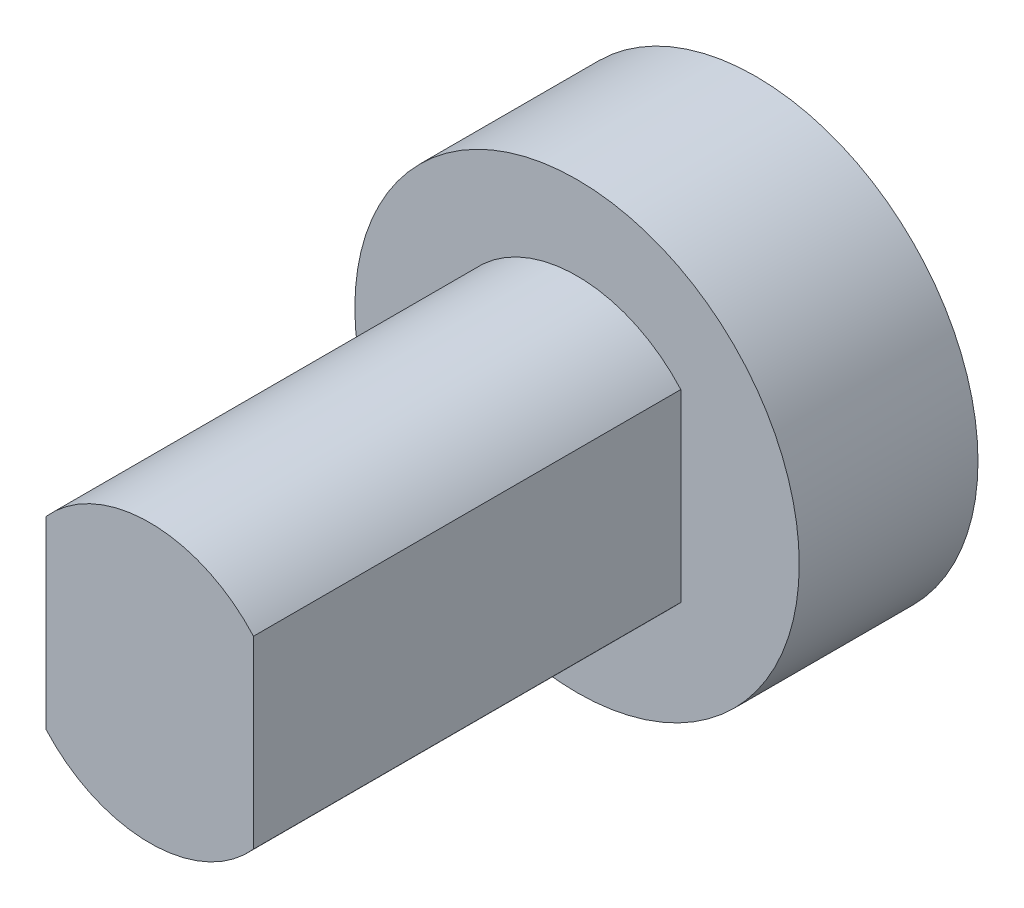
ISO-10303-21;
HEADER;
FILE_DESCRIPTION(('STEP AP214'),'2;1');
FILE_NAME('part.step','',(''),(''),'','','');
FILE_SCHEMA(('AUTOMOTIVE_DESIGN { 1 0 10303 214 1 1 1 1 }'));
ENDSEC;
DATA;
#1=APPLICATION_CONTEXT('core data for automotive mechanical design processes');
#2=APPLICATION_PROTOCOL_DEFINITION('international standard','automotive_design',2000,#1);
#3=PRODUCT_CONTEXT('',#1,'mechanical');
#4=PRODUCT('Part','Part','',(#3));
#5=PRODUCT_RELATED_PRODUCT_CATEGORY('part','',(#4));
#6=PRODUCT_DEFINITION_FORMATION('','',#4);
#7=PRODUCT_DEFINITION_CONTEXT('part definition',#1,'design');
#8=PRODUCT_DEFINITION('design','',#6,#7);
#9=PRODUCT_DEFINITION_SHAPE('','',#8);
#10=(LENGTH_UNIT() NAMED_UNIT(*) SI_UNIT(.MILLI.,.METRE.));
#11=(NAMED_UNIT(*) PLANE_ANGLE_UNIT() SI_UNIT($,.RADIAN.));
#12=(NAMED_UNIT(*) SI_UNIT($,.STERADIAN.) SOLID_ANGLE_UNIT());
#13=UNCERTAINTY_MEASURE_WITH_UNIT(LENGTH_MEASURE(1.E-05),#10,'distance_accuracy_value','');
#14=(GEOMETRIC_REPRESENTATION_CONTEXT(3) GLOBAL_UNCERTAINTY_ASSIGNED_CONTEXT((#13)) GLOBAL_UNIT_ASSIGNED_CONTEXT((#10,
#11,#12)) REPRESENTATION_CONTEXT('',''));
#15=CARTESIAN_POINT('',(0.,0.,0.));
#16=DIRECTION('',(0.,0.,1.));
#17=DIRECTION('',(1.,0.,0.));
#18=AXIS2_PLACEMENT_3D('',#15,#16,#17);
#19=CARTESIAN_POINT('',(0.,-11.0314213562373,0.));
#20=DIRECTION('',(0.,0.,1.));
#21=DIRECTION('',(1.,0.,0.));
#22=AXIS2_PLACEMENT_3D('',#19,#20,#21);
#23=PLANE('',#22);
#24=DIRECTION('',(0.,1.,0.));
#25=VECTOR('',#24,1.);
#26=CARTESIAN_POINT('',(-3.7,-11.0314213562373,0.));
#27=LINE('',#26,#25);
#28=CARTESIAN_POINT('',(-3.7,-3.28823660949147,0.));
#29=VERTEX_POINT('',#28);
#30=CARTESIAN_POINT('',(-3.7,3.28823660949147,0.));
#31=VERTEX_POINT('',#30);
#32=EDGE_CURVE('E66',#29,#31,#27,.T.);
#33=ORIENTED_EDGE('',*,*,#32,.F.);
#34=CARTESIAN_POINT('',(0.,0.,0.));
#35=DIRECTION('',(0.,0.,1.));
#36=DIRECTION('',(1.,0.,0.));
#37=AXIS2_PLACEMENT_3D('',#34,#35,#36);
#38=CIRCLE('',#37,4.95);
#39=CARTESIAN_POINT('',(3.7,-3.28823660949147,0.));
#40=VERTEX_POINT('',#39);
#41=EDGE_CURVE('E79',#40,#29,#38,.F.);
#42=ORIENTED_EDGE('',*,*,#41,.F.);
#43=DIRECTION('',(0.,1.,0.));
#44=VECTOR('',#43,1.);
#45=CARTESIAN_POINT('',(3.7,-11.0314213562373,0.));
#46=LINE('',#45,#44);
#47=CARTESIAN_POINT('',(3.7,3.28823660949147,0.));
#48=VERTEX_POINT('',#47);
#49=EDGE_CURVE('E69',#48,#40,#46,.F.);
#50=ORIENTED_EDGE('',*,*,#49,.F.);
#51=CARTESIAN_POINT('',(0.,0.,0.));
#52=DIRECTION('',(0.,0.,1.));
#53=DIRECTION('',(1.,0.,0.));
#54=AXIS2_PLACEMENT_3D('',#51,#52,#53);
#55=CIRCLE('',#54,4.95);
#56=EDGE_CURVE('E28',#31,#48,#55,.F.);
#57=ORIENTED_EDGE('',*,*,#56,.F.);
#58=EDGE_LOOP('',(#33,#42,#50,#57));
#59=FACE_BOUND('',#58,.T.);
#60=ADVANCED_FACE('F25',(#59),#23,.T.);
#61=CARTESIAN_POINT('',(0.,0.,-15.24));
#62=DIRECTION('',(0.,0.,1.));
#63=DIRECTION('',(1.,0.,0.));
#64=AXIS2_PLACEMENT_3D('',#61,#62,#63);
#65=CYLINDRICAL_SURFACE('',#64,4.95);
#66=CARTESIAN_POINT('',(0.,0.,-15.24));
#67=DIRECTION('',(0.,0.,1.));
#68=DIRECTION('',(1.,0.,0.));
#69=AXIS2_PLACEMENT_3D('',#66,#67,#68);
#70=CIRCLE('',#69,4.95);
#71=CARTESIAN_POINT('',(3.7,3.28823660949147,-15.24));
#72=VERTEX_POINT('',#71);
#73=CARTESIAN_POINT('',(-3.7,3.28823660949147,-15.24));
#74=VERTEX_POINT('',#73);
#75=EDGE_CURVE('E76',#72,#74,#70,.T.);
#76=ORIENTED_EDGE('',*,*,#75,.T.);
#77=DIRECTION('',(0.,0.,1.));
#78=VECTOR('',#77,1.);
#79=CARTESIAN_POINT('',(-3.7,3.28823660949148,-15.24));
#80=LINE('',#79,#78);
#81=EDGE_CURVE('E73',#31,#74,#80,.F.);
#82=ORIENTED_EDGE('',*,*,#81,.F.);
#83=ORIENTED_EDGE('',*,*,#56,.T.);
#84=DIRECTION('',(0.,0.,-1.));
#85=VECTOR('',#84,1.);
#86=CARTESIAN_POINT('',(3.7,3.28823660949147,-15.24));
#87=LINE('',#86,#85);
#88=EDGE_CURVE('E92',#72,#48,#87,.F.);
#89=ORIENTED_EDGE('',*,*,#88,.F.);
#90=EDGE_LOOP('',(#76,#82,#83,#89));
#91=FACE_BOUND('',#90,.T.);
#92=ADVANCED_FACE('F74',(#91),#65,.T.);
#93=CARTESIAN_POINT('',(-3.7,-11.0314213562373,-15.24));
#94=DIRECTION('',(-1.,0.,0.));
#95=DIRECTION('',(0.,0.,1.));
#96=AXIS2_PLACEMENT_3D('',#93,#94,#95);
#97=PLANE('',#96);
#98=DIRECTION('',(0.,1.,0.));
#99=VECTOR('',#98,1.);
#100=CARTESIAN_POINT('',(-3.7,0.,-15.24));
#101=LINE('',#100,#99);
#102=CARTESIAN_POINT('',(-3.7,-3.28823660949147,-15.24));
#103=VERTEX_POINT('',#102);
#104=EDGE_CURVE('E91',#74,#103,#101,.F.);
#105=ORIENTED_EDGE('',*,*,#104,.T.);
#106=DIRECTION('',(0.,0.,1.));
#107=VECTOR('',#106,1.);
#108=CARTESIAN_POINT('',(-3.7,-3.28823660949148,-15.24));
#109=LINE('',#108,#107);
#110=EDGE_CURVE('E82',#29,#103,#109,.F.);
#111=ORIENTED_EDGE('',*,*,#110,.F.);
#112=ORIENTED_EDGE('',*,*,#32,.T.);
#113=ORIENTED_EDGE('',*,*,#81,.T.);
#114=EDGE_LOOP('',(#105,#111,#112,#113));
#115=FACE_BOUND('',#114,.T.);
#116=ADVANCED_FACE('F81',(#115),#97,.T.);
#117=CARTESIAN_POINT('',(0.,0.,-15.24));
#118=DIRECTION('',(0.,0.,1.));
#119=DIRECTION('',(1.,0.,0.));
#120=AXIS2_PLACEMENT_3D('',#117,#118,#119);
#121=CYLINDRICAL_SURFACE('',#120,4.95);
#122=CARTESIAN_POINT('',(0.,0.,-15.24));
#123=DIRECTION('',(0.,0.,1.));
#124=DIRECTION('',(1.,0.,0.));
#125=AXIS2_PLACEMENT_3D('',#122,#123,#124);
#126=CIRCLE('',#125,4.95);
#127=CARTESIAN_POINT('',(3.7,-3.28823660949147,-15.24));
#128=VERTEX_POINT('',#127);
#129=EDGE_CURVE('E43',#103,#128,#126,.T.);
#130=ORIENTED_EDGE('',*,*,#129,.T.);
#131=DIRECTION('',(0.,0.,-1.));
#132=VECTOR('',#131,1.);
#133=CARTESIAN_POINT('',(3.7,-3.28823660949148,-15.24));
#134=LINE('',#133,#132);
#135=EDGE_CURVE('E94',#40,#128,#134,.T.);
#136=ORIENTED_EDGE('',*,*,#135,.F.);
#137=ORIENTED_EDGE('',*,*,#41,.T.);
#138=ORIENTED_EDGE('',*,*,#110,.T.);
#139=EDGE_LOOP('',(#130,#136,#137,#138));
#140=FACE_BOUND('',#139,.T.);
#141=ADVANCED_FACE('F117',(#140),#121,.T.);
#142=CARTESIAN_POINT('',(3.7,-11.0314213562373,-15.24));
#143=DIRECTION('',(1.,0.,0.));
#144=DIRECTION('',(0.,0.,-1.));
#145=AXIS2_PLACEMENT_3D('',#142,#143,#144);
#146=PLANE('',#145);
#147=DIRECTION('',(0.,1.,0.));
#148=VECTOR('',#147,1.);
#149=CARTESIAN_POINT('',(3.7,0.,-15.24));
#150=LINE('',#149,#148);
#151=EDGE_CURVE('E89',#128,#72,#150,.T.);
#152=ORIENTED_EDGE('',*,*,#151,.T.);
#153=ORIENTED_EDGE('',*,*,#88,.T.);
#154=ORIENTED_EDGE('',*,*,#49,.T.);
#155=ORIENTED_EDGE('',*,*,#135,.T.);
#156=EDGE_LOOP('',(#152,#153,#154,#155));
#157=FACE_BOUND('',#156,.T.);
#158=ADVANCED_FACE('F102',(#157),#146,.T.);
#159=CARTESIAN_POINT('',(0.,0.,-15.24));
#160=DIRECTION('',(0.,0.,-1.));
#161=DIRECTION('',(-1.,0.,0.));
#162=AXIS2_PLACEMENT_3D('',#159,#160,#161);
#163=PLANE('',#162);
#164=CARTESIAN_POINT('',(0.,0.,-15.24));
#165=DIRECTION('',(0.,0.,1.));
#166=DIRECTION('',(1.,0.,0.));
#167=AXIS2_PLACEMENT_3D('',#164,#165,#166);
#168=CIRCLE('',#167,7.9248);
#169=CARTESIAN_POINT('',(7.9248,0.,-15.24));
#170=VERTEX_POINT('',#169);
#171=EDGE_CURVE('E34',#170,#170,#168,.F.);
#172=ORIENTED_EDGE('',*,*,#171,.F.);
#173=EDGE_LOOP('',(#172));
#174=FACE_BOUND('',#173,.T.);
#175=ORIENTED_EDGE('',*,*,#129,.F.);
#176=ORIENTED_EDGE('',*,*,#104,.F.);
#177=ORIENTED_EDGE('',*,*,#75,.F.);
#178=ORIENTED_EDGE('',*,*,#151,.F.);
#179=EDGE_LOOP('',(#175,#176,#177,#178));
#180=FACE_BOUND('',#179,.T.);
#181=ADVANCED_FACE('F104',(#174,#180),#163,.F.);
#182=CARTESIAN_POINT('',(0.,0.,-21.6154));
#183=DIRECTION('',(0.,0.,1.));
#184=DIRECTION('',(1.,0.,0.));
#185=AXIS2_PLACEMENT_3D('',#182,#183,#184);
#186=CYLINDRICAL_SURFACE('',#185,7.9248);
#187=ORIENTED_EDGE('',*,*,#171,.T.);
#188=EDGE_LOOP('',(#187));
#189=FACE_BOUND('',#188,.T.);
#190=CARTESIAN_POINT('',(0.,0.,-21.6154));
#191=DIRECTION('',(0.,0.,1.));
#192=DIRECTION('',(1.,0.,0.));
#193=AXIS2_PLACEMENT_3D('',#190,#191,#192);
#194=CIRCLE('',#193,7.9248);
#195=CARTESIAN_POINT('',(7.9248,0.,-21.6154));
#196=VERTEX_POINT('',#195);
#197=EDGE_CURVE('E13',#196,#196,#194,.F.);
#198=ORIENTED_EDGE('',*,*,#197,.F.);
#199=EDGE_LOOP('',(#198));
#200=FACE_BOUND('',#199,.T.);
#201=ADVANCED_FACE('F106',(#189,#200),#186,.T.);
#202=CARTESIAN_POINT('',(0.,0.,-21.6154));
#203=DIRECTION('',(0.,0.,-1.));
#204=DIRECTION('',(-1.,0.,0.));
#205=AXIS2_PLACEMENT_3D('',#202,#203,#204);
#206=PLANE('',#205);
#207=ORIENTED_EDGE('',*,*,#197,.T.);
#208=EDGE_LOOP('',(#207));
#209=FACE_BOUND('',#208,.T.);
#210=ADVANCED_FACE('F114',(#209),#206,.T.);
#211=CLOSED_SHELL('',(#60,#92,#116,#141,#158,#181,#201,#210));
#212=MANIFOLD_SOLID_BREP('B1',#211);
#213=ADVANCED_BREP_SHAPE_REPRESENTATION('',(#18,#212),#14);
#214=SHAPE_DEFINITION_REPRESENTATION(#9,#213);
ENDSEC;
END-ISO-10303-21;
